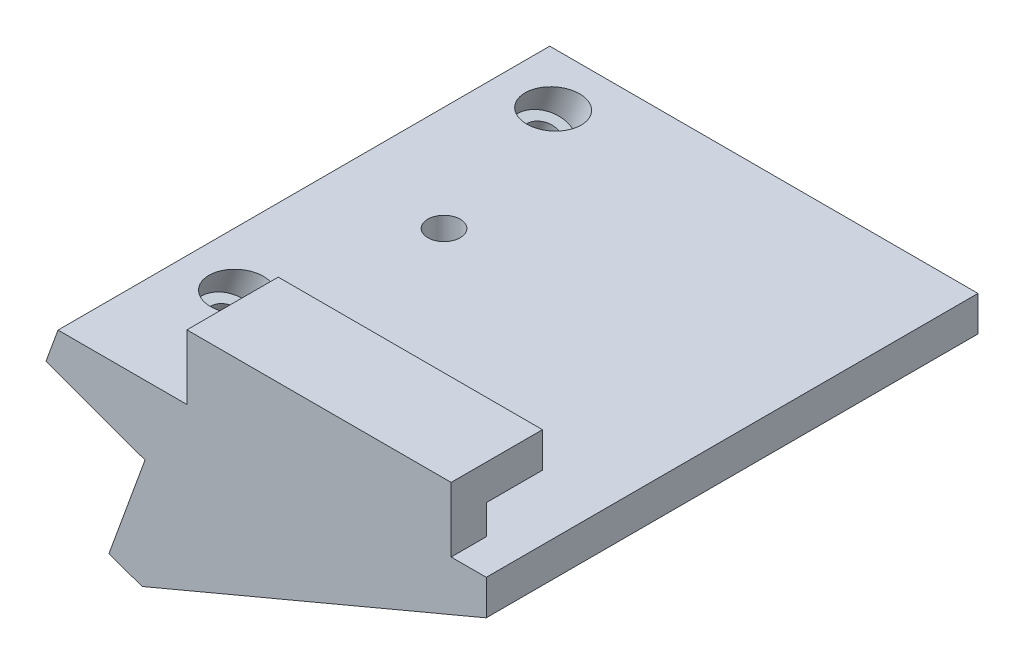
ISO-10303-21;
HEADER;
FILE_DESCRIPTION(('STEP AP214'),'2;1');
FILE_NAME('part.step','',(''),(''),'','','');
FILE_SCHEMA(('AUTOMOTIVE_DESIGN { 1 0 10303 214 1 1 1 1 }'));
ENDSEC;
DATA;
#1=APPLICATION_CONTEXT('core data for automotive mechanical design processes');
#2=APPLICATION_PROTOCOL_DEFINITION('international standard','automotive_design',2000,#1);
#3=PRODUCT_CONTEXT('',#1,'mechanical');
#4=PRODUCT('Part','Part','',(#3));
#5=PRODUCT_RELATED_PRODUCT_CATEGORY('part','',(#4));
#6=PRODUCT_DEFINITION_FORMATION('','',#4);
#7=PRODUCT_DEFINITION_CONTEXT('part definition',#1,'design');
#8=PRODUCT_DEFINITION('design','',#6,#7);
#9=PRODUCT_DEFINITION_SHAPE('','',#8);
#10=(LENGTH_UNIT() NAMED_UNIT(*) SI_UNIT(.MILLI.,.METRE.));
#11=(NAMED_UNIT(*) PLANE_ANGLE_UNIT() SI_UNIT($,.RADIAN.));
#12=(NAMED_UNIT(*) SI_UNIT($,.STERADIAN.) SOLID_ANGLE_UNIT());
#13=UNCERTAINTY_MEASURE_WITH_UNIT(LENGTH_MEASURE(1.E-05),#10,'distance_accuracy_value','');
#14=(GEOMETRIC_REPRESENTATION_CONTEXT(3) GLOBAL_UNCERTAINTY_ASSIGNED_CONTEXT((#13)) GLOBAL_UNIT_ASSIGNED_CONTEXT((#10,
#11,#12)) REPRESENTATION_CONTEXT('',''));
#15=CARTESIAN_POINT('',(0.,0.,0.));
#16=DIRECTION('',(0.,0.,1.));
#17=DIRECTION('',(1.,0.,0.));
#18=AXIS2_PLACEMENT_3D('',#15,#16,#17);
#19=CARTESIAN_POINT('',(0.,0.,65.));
#20=DIRECTION('',(0.,0.,-1.));
#21=DIRECTION('',(-1.,0.,0.));
#22=AXIS2_PLACEMENT_3D('',#19,#20,#21);
#23=PLANE('',#22);
#24=DIRECTION('',(0.,1.,0.));
#25=VECTOR('',#24,1.);
#26=CARTESIAN_POINT('',(48.7076801418633,28.1241545656032,65.));
#27=LINE('',#26,#25);
#28=CARTESIAN_POINT('',(48.7076801418633,23.9241545656032,65.));
#29=VERTEX_POINT('',#28);
#30=CARTESIAN_POINT('',(48.7076801418633,28.1241545656032,65.));
#31=VERTEX_POINT('',#30);
#32=EDGE_CURVE('E137',#29,#31,#27,.T.);
#33=ORIENTED_EDGE('',*,*,#32,.F.);
#34=DIRECTION('',(-1.,0.,0.));
#35=VECTOR('',#34,1.);
#36=CARTESIAN_POINT('',(-7.25498644527533,23.9241545656032,65.));
#37=LINE('',#36,#35);
#38=CARTESIAN_POINT('',(11.0935397099737,23.9241545656032,65.));
#39=VERTEX_POINT('',#38);
#40=EDGE_CURVE('E201',#29,#39,#37,.T.);
#41=ORIENTED_EDGE('',*,*,#40,.T.);
#42=DIRECTION('',(0.,-1.,0.));
#43=VECTOR('',#42,1.);
#44=CARTESIAN_POINT('',(11.0935397099737,0.,65.));
#45=LINE('',#44,#43);
#46=CARTESIAN_POINT('',(11.0935397099737,28.1241545656032,65.));
#47=VERTEX_POINT('',#46);
#48=EDGE_CURVE('E156',#47,#39,#45,.T.);
#49=ORIENTED_EDGE('',*,*,#48,.F.);
#50=DIRECTION('',(-1.,0.,0.));
#51=VECTOR('',#50,1.);
#52=CARTESIAN_POINT('',(-5.72631146135729,28.1241545656032,65.));
#53=LINE('',#52,#51);
#54=EDGE_CURVE('E149',#31,#47,#53,.T.);
#55=ORIENTED_EDGE('',*,*,#54,.F.);
#56=EDGE_LOOP('',(#33,#41,#49,#55));
#57=FACE_BOUND('',#56,.T.);
#58=ADVANCED_FACE('F41',(#57),#23,.T.);
#59=CARTESIAN_POINT('',(4.69846310392955,-1.71010071662833,65.));
#60=DIRECTION('',(0.342020143325665,0.93969262078591,0.));
#61=DIRECTION('',(-0.93969262078591,0.342020143325665,0.));
#62=AXIS2_PLACEMENT_3D('',#59,#60,#61);
#63=PLANE('',#62);
#64=DIRECTION('',(0.93969262078591,-0.342020143325665,0.));
#65=VECTOR('',#64,1.);
#66=CARTESIAN_POINT('',(4.69846310392955,-1.71010071662833,0.));
#67=LINE('',#66,#65);
#68=CARTESIAN_POINT('',(0.,0.,0.));
#69=VERTEX_POINT('',#68);
#70=CARTESIAN_POINT('',(4.69846310392955,-1.71010071662833,0.));
#71=VERTEX_POINT('',#70);
#72=EDGE_CURVE('E197',#69,#71,#67,.T.);
#73=ORIENTED_EDGE('',*,*,#72,.T.);
#74=DIRECTION('',(0.,0.,-1.));
#75=VECTOR('',#74,1.);
#76=CARTESIAN_POINT('',(4.69846310392955,-1.71010071662833,65.));
#77=LINE('',#76,#75);
#78=CARTESIAN_POINT('',(4.69846310392955,-1.71010071662833,70.));
#79=VERTEX_POINT('',#78);
#80=EDGE_CURVE('E11',#79,#71,#77,.T.);
#81=ORIENTED_EDGE('',*,*,#80,.F.);
#82=DIRECTION('',(-0.93969262078591,0.342020143325665,0.));
#83=VECTOR('',#82,1.);
#84=CARTESIAN_POINT('',(4.69846310392955,-1.71010071662833,70.));
#85=LINE('',#84,#83);
#86=CARTESIAN_POINT('',(0.,0.,70.));
#87=VERTEX_POINT('',#86);
#88=EDGE_CURVE('E175',#79,#87,#85,.T.);
#89=ORIENTED_EDGE('',*,*,#88,.T.);
#90=DIRECTION('',(0.,0.,-1.));
#91=VECTOR('',#90,1.);
#92=CARTESIAN_POINT('',(0.,0.,65.));
#93=LINE('',#92,#91);
#94=EDGE_CURVE('E203',#87,#69,#93,.T.);
#95=ORIENTED_EDGE('',*,*,#94,.T.);
#96=EDGE_LOOP('',(#73,#81,#89,#95));
#97=FACE_BOUND('',#96,.T.);
#98=ADVANCED_FACE('F43',(#97),#63,.F.);
#99=CARTESIAN_POINT('',(53.7076801418633,18.9241545656032,65.));
#100=DIRECTION('',(-0.388037759372495,0.921643476242942,0.));
#101=DIRECTION('',(-0.921643476242942,-0.388037759372495,0.));
#102=AXIS2_PLACEMENT_3D('',#99,#100,#101);
#103=PLANE('',#102);
#104=DIRECTION('',(0.921643476242942,0.388037759372495,0.));
#105=VECTOR('',#104,1.);
#106=CARTESIAN_POINT('',(53.7076801418633,18.9241545656032,0.));
#107=LINE('',#106,#105);
#108=CARTESIAN_POINT('',(53.7076801418633,18.9241545656032,0.));
#109=VERTEX_POINT('',#108);
#110=EDGE_CURVE('E207',#71,#109,#107,.T.);
#111=ORIENTED_EDGE('',*,*,#110,.T.);
#112=DIRECTION('',(0.,0.,-1.));
#113=VECTOR('',#112,1.);
#114=CARTESIAN_POINT('',(53.7076801418633,18.9241545656032,65.));
#115=LINE('',#114,#113);
#116=CARTESIAN_POINT('',(53.7076801418633,18.9241545656032,70.));
#117=VERTEX_POINT('',#116);
#118=EDGE_CURVE('E50',#117,#109,#115,.T.);
#119=ORIENTED_EDGE('',*,*,#118,.F.);
#120=DIRECTION('',(-0.921643476242942,-0.388037759372495,0.));
#121=VECTOR('',#120,1.);
#122=CARTESIAN_POINT('',(53.7076801418633,18.9241545656032,70.));
#123=LINE('',#122,#121);
#124=EDGE_CURVE('E172',#117,#79,#123,.T.);
#125=ORIENTED_EDGE('',*,*,#124,.T.);
#126=ORIENTED_EDGE('',*,*,#80,.T.);
#127=EDGE_LOOP('',(#111,#119,#125,#126));
#128=FACE_BOUND('',#127,.T.);
#129=ADVANCED_FACE('F271',(#128),#103,.F.);
#130=CARTESIAN_POINT('',(53.7076801418633,23.9241545656032,65.));
#131=DIRECTION('',(-1.,0.,0.));
#132=DIRECTION('',(0.,0.,1.));
#133=AXIS2_PLACEMENT_3D('',#130,#131,#132);
#134=PLANE('',#133);
#135=DIRECTION('',(0.,0.,-1.));
#136=VECTOR('',#135,1.);
#137=CARTESIAN_POINT('',(53.7076801418633,23.9241545656032,65.));
#138=LINE('',#137,#136);
#139=CARTESIAN_POINT('',(53.7076801418633,23.9241545656032,70.));
#140=VERTEX_POINT('',#139);
#141=CARTESIAN_POINT('',(53.7076801418633,23.9241545656032,0.));
#142=VERTEX_POINT('',#141);
#143=EDGE_CURVE('E229',#140,#142,#138,.T.);
#144=ORIENTED_EDGE('',*,*,#143,.F.);
#145=DIRECTION('',(0.,-1.,0.));
#146=VECTOR('',#145,1.);
#147=CARTESIAN_POINT('',(53.7076801418633,33.1241545656032,70.));
#148=LINE('',#147,#146);
#149=EDGE_CURVE('E170',#140,#117,#148,.T.);
#150=ORIENTED_EDGE('',*,*,#149,.T.);
#151=ORIENTED_EDGE('',*,*,#118,.T.);
#152=DIRECTION('',(0.,1.,0.));
#153=VECTOR('',#152,1.);
#154=CARTESIAN_POINT('',(53.7076801418633,23.9241545656032,0.));
#155=LINE('',#154,#153);
#156=EDGE_CURVE('E209',#109,#142,#155,.T.);
#157=ORIENTED_EDGE('',*,*,#156,.T.);
#158=EDGE_LOOP('',(#144,#150,#151,#157));
#159=FACE_BOUND('',#158,.T.);
#160=ADVANCED_FACE('F317',(#159),#134,.F.);
#161=CARTESIAN_POINT('',(-7.25498644527533,23.9241545656032,65.));
#162=DIRECTION('',(0.,-1.,0.));
#163=DIRECTION('',(0.,0.,-1.));
#164=AXIS2_PLACEMENT_3D('',#161,#162,#163);
#165=PLANE('',#164);
#166=DIRECTION('',(0.,0.,-1.));
#167=VECTOR('',#166,1.);
#168=CARTESIAN_POINT('',(-7.25498644527533,23.9241545656032,65.));
#169=LINE('',#168,#167);
#170=CARTESIAN_POINT('',(-7.25498644527533,23.9241545656032,70.));
#171=VERTEX_POINT('',#170);
#172=CARTESIAN_POINT('',(-7.25498644527533,23.9241545656032,0.));
#173=VERTEX_POINT('',#172);
#174=EDGE_CURVE('E227',#171,#173,#169,.T.);
#175=ORIENTED_EDGE('',*,*,#174,.F.);
#176=DIRECTION('',(-1.,0.,0.));
#177=VECTOR('',#176,1.);
#178=CARTESIAN_POINT('',(-7.25498644527533,23.9241545656032,70.));
#179=LINE('',#178,#177);
#180=CARTESIAN_POINT('',(11.0935397099737,23.9241545656032,70.));
#181=VERTEX_POINT('',#180);
#182=EDGE_CURVE('E298',#181,#171,#179,.T.);
#183=ORIENTED_EDGE('',*,*,#182,.F.);
#184=DIRECTION('',(0.,0.,-1.));
#185=VECTOR('',#184,1.);
#186=CARTESIAN_POINT('',(11.0935397099737,23.9241545656032,70.));
#187=LINE('',#186,#185);
#188=EDGE_CURVE('E304',#181,#39,#187,.T.);
#189=ORIENTED_EDGE('',*,*,#188,.T.);
#190=ORIENTED_EDGE('',*,*,#40,.F.);
#191=DIRECTION('',(0.,0.,-1.));
#192=VECTOR('',#191,1.);
#193=CARTESIAN_POINT('',(48.7076801418633,23.9241545656032,65.));
#194=LINE('',#193,#192);
#195=CARTESIAN_POINT('',(48.7076801418633,23.9241545656032,70.));
#196=VERTEX_POINT('',#195);
#197=EDGE_CURVE('E140',#196,#29,#194,.T.);
#198=ORIENTED_EDGE('',*,*,#197,.F.);
#199=DIRECTION('',(1.,0.,0.));
#200=VECTOR('',#199,1.);
#201=CARTESIAN_POINT('',(48.7076801418633,23.9241545656032,70.));
#202=LINE('',#201,#200);
#203=EDGE_CURVE('E295',#196,#140,#202,.T.);
#204=ORIENTED_EDGE('',*,*,#203,.T.);
#205=ORIENTED_EDGE('',*,*,#143,.T.);
#206=DIRECTION('',(-1.,0.,0.));
#207=VECTOR('',#206,1.);
#208=CARTESIAN_POINT('',(-7.25498644527533,23.9241545656032,0.));
#209=LINE('',#208,#207);
#210=EDGE_CURVE('E211',#142,#173,#209,.T.);
#211=ORIENTED_EDGE('',*,*,#210,.T.);
#212=EDGE_LOOP('',(#175,#183,#189,#190,#198,#204,#205,#211));
#213=FACE_BOUND('',#212,.T.);
#214=CARTESIAN_POINT('',(7.69501355472467,23.9241545656032,30.));
#215=DIRECTION('',(0.,1.,0.));
#216=DIRECTION('',(0.,0.,1.));
#217=AXIS2_PLACEMENT_3D('',#214,#215,#216);
#218=CIRCLE('',#217,2.3);
#219=CARTESIAN_POINT('',(7.69501355472467,23.9241545656032,32.3));
#220=VERTEX_POINT('',#219);
#221=EDGE_CURVE('E163',#220,#220,#218,.T.);
#222=ORIENTED_EDGE('',*,*,#221,.F.);
#223=EDGE_LOOP('',(#222));
#224=FACE_BOUND('',#223,.T.);
#225=CARTESIAN_POINT('',(0.726346848294,23.9241545656032,52.5));
#226=DIRECTION('',(0.,-1.,0.));
#227=DIRECTION('',(-1.,0.,0.));
#228=AXIS2_PLACEMENT_3D('',#225,#226,#227);
#229=ELLIPSE('',#228,3.99066664678467,3.75);
#230=CARTESIAN_POINT('',(-3.26431979849067,23.9241545656032,52.5));
#231=VERTEX_POINT('',#230);
#232=EDGE_CURVE('E45',#231,#231,#229,.T.);
#233=ORIENTED_EDGE('',*,*,#232,.T.);
#234=EDGE_LOOP('',(#233));
#235=FACE_BOUND('',#234,.T.);
#236=CARTESIAN_POINT('',(0.726346848293999,23.9241545656032,7.5));
#237=DIRECTION('',(0.,-1.,0.));
#238=DIRECTION('',(-1.,0.,0.));
#239=AXIS2_PLACEMENT_3D('',#236,#237,#238);
#240=ELLIPSE('',#239,3.99066664678467,3.75);
#241=CARTESIAN_POINT('',(-3.26431979849067,23.9241545656032,7.5));
#242=VERTEX_POINT('',#241);
#243=EDGE_CURVE('E238',#242,#242,#240,.T.);
#244=ORIENTED_EDGE('',*,*,#243,.T.);
#245=EDGE_LOOP('',(#244));
#246=FACE_BOUND('',#245,.T.);
#247=ADVANCED_FACE('F245',(#213,#224,#235,#246),#165,.F.);
#248=CARTESIAN_POINT('',(-8.96508716190366,19.2256914616736,65.));
#249=DIRECTION('',(0.93969262078591,-0.342020143325665,0.));
#250=DIRECTION('',(0.342020143325665,0.93969262078591,0.));
#251=AXIS2_PLACEMENT_3D('',#248,#249,#250);
#252=PLANE('',#251);
#253=DIRECTION('',(0.342020143325666,0.939692620785909,0.));
#254=VECTOR('',#253,1.);
#255=CARTESIAN_POINT('',(-8.96508716190366,19.2256914616736,70.));
#256=LINE('',#255,#254);
#257=CARTESIAN_POINT('',(-8.96508716190366,19.2256914616736,70.));
#258=VERTEX_POINT('',#257);
#259=EDGE_CURVE('E184',#258,#171,#256,.T.);
#260=ORIENTED_EDGE('',*,*,#259,.T.);
#261=ORIENTED_EDGE('',*,*,#174,.T.);
#262=DIRECTION('',(-0.342020143325665,-0.939692620785909,0.));
#263=VECTOR('',#262,1.);
#264=CARTESIAN_POINT('',(-8.96508716190366,19.2256914616736,0.));
#265=LINE('',#264,#263);
#266=CARTESIAN_POINT('',(-8.96508716190366,19.2256914616736,0.));
#267=VERTEX_POINT('',#266);
#268=EDGE_CURVE('E214',#173,#267,#265,.T.);
#269=ORIENTED_EDGE('',*,*,#268,.T.);
#270=DIRECTION('',(0.,0.,-1.));
#271=VECTOR('',#270,1.);
#272=CARTESIAN_POINT('',(-8.96508716190366,19.2256914616736,65.));
#273=LINE('',#272,#271);
#274=EDGE_CURVE('E224',#258,#267,#273,.T.);
#275=ORIENTED_EDGE('',*,*,#274,.F.);
#276=EDGE_LOOP('',(#260,#261,#269,#275));
#277=FACE_BOUND('',#276,.T.);
#278=ADVANCED_FACE('F316',(#277),#252,.F.);
#279=CARTESIAN_POINT('',(5.13030214988498,14.0953893117886,65.));
#280=DIRECTION('',(0.342020143325666,0.939692620785909,0.));
#281=DIRECTION('',(-0.93969262078591,0.342020143325666,0.));
#282=AXIS2_PLACEMENT_3D('',#279,#280,#281);
#283=PLANE('',#282);
#284=CARTESIAN_POINT('',(-1.91739250600933,16.6605403867311,7.5));
#285=DIRECTION('',(-0.342020143325666,-0.93969262078591,0.));
#286=DIRECTION('',(0.93969262078591,-0.342020143325666,0.));
#287=AXIS2_PLACEMENT_3D('',#284,#285,#286);
#288=CIRCLE('',#287,2.25);
#289=CARTESIAN_POINT('',(0.196915890758964,15.8909950642484,7.5));
#290=VERTEX_POINT('',#289);
#291=EDGE_CURVE('E194',#290,#290,#288,.T.);
#292=ORIENTED_EDGE('',*,*,#291,.F.);
#293=EDGE_LOOP('',(#292));
#294=FACE_BOUND('',#293,.T.);
#295=CARTESIAN_POINT('',(-1.91739250600933,16.6605403867311,52.5));
#296=DIRECTION('',(-0.342020143325666,-0.93969262078591,0.));
#297=DIRECTION('',(0.93969262078591,-0.342020143325666,0.));
#298=AXIS2_PLACEMENT_3D('',#295,#296,#297);
#299=CIRCLE('',#298,2.25);
#300=CARTESIAN_POINT('',(0.196915890758965,15.8909950642484,52.5));
#301=VERTEX_POINT('',#300);
#302=EDGE_CURVE('E198',#301,#301,#299,.T.);
#303=ORIENTED_EDGE('',*,*,#302,.F.);
#304=EDGE_LOOP('',(#303));
#305=FACE_BOUND('',#304,.T.);
#306=DIRECTION('',(0.93969262078591,-0.342020143325666,0.));
#307=VECTOR('',#306,1.);
#308=CARTESIAN_POINT('',(5.13030214988498,14.0953893117886,0.));
#309=LINE('',#308,#307);
#310=CARTESIAN_POINT('',(5.13030214988498,14.0953893117886,0.));
#311=VERTEX_POINT('',#310);
#312=EDGE_CURVE('E216',#267,#311,#309,.T.);
#313=ORIENTED_EDGE('',*,*,#312,.T.);
#314=DIRECTION('',(0.,0.,-1.));
#315=VECTOR('',#314,1.);
#316=CARTESIAN_POINT('',(5.13030214988498,14.0953893117886,65.));
#317=LINE('',#316,#315);
#318=CARTESIAN_POINT('',(5.13030214988498,14.0953893117886,70.));
#319=VERTEX_POINT('',#318);
#320=EDGE_CURVE('E221',#319,#311,#317,.T.);
#321=ORIENTED_EDGE('',*,*,#320,.F.);
#322=DIRECTION('',(-0.93969262078591,0.342020143325666,0.));
#323=VECTOR('',#322,1.);
#324=CARTESIAN_POINT('',(5.13030214988498,14.0953893117886,70.));
#325=LINE('',#324,#323);
#326=EDGE_CURVE('E181',#319,#258,#325,.T.);
#327=ORIENTED_EDGE('',*,*,#326,.T.);
#328=ORIENTED_EDGE('',*,*,#274,.T.);
#329=EDGE_LOOP('',(#313,#321,#327,#328));
#330=FACE_BOUND('',#329,.T.);
#331=ADVANCED_FACE('F323',(#294,#305,#330),#283,.F.);
#332=CARTESIAN_POINT('',(0.,0.,65.));
#333=DIRECTION('',(0.939692620785909,-0.342020143325666,0.));
#334=DIRECTION('',(0.342020143325666,0.93969262078591,0.));
#335=AXIS2_PLACEMENT_3D('',#332,#333,#334);
#336=PLANE('',#335);
#337=DIRECTION('',(-0.342020143325666,-0.939692620785909,0.));
#338=VECTOR('',#337,1.);
#339=CARTESIAN_POINT('',(0.,0.,0.));
#340=LINE('',#339,#338);
#341=EDGE_CURVE('E204',#311,#69,#340,.T.);
#342=ORIENTED_EDGE('',*,*,#341,.T.);
#343=ORIENTED_EDGE('',*,*,#94,.F.);
#344=DIRECTION('',(0.342020143325666,0.939692620785909,0.));
#345=VECTOR('',#344,1.);
#346=CARTESIAN_POINT('',(0.,0.,70.));
#347=LINE('',#346,#345);
#348=EDGE_CURVE('E178',#87,#319,#347,.T.);
#349=ORIENTED_EDGE('',*,*,#348,.T.);
#350=ORIENTED_EDGE('',*,*,#320,.T.);
#351=EDGE_LOOP('',(#342,#343,#349,#350));
#352=FACE_BOUND('',#351,.T.);
#353=ADVANCED_FACE('F352',(#352),#336,.F.);
#354=CARTESIAN_POINT('',(0.,0.,0.));
#355=DIRECTION('',(0.,0.,-1.));
#356=DIRECTION('',(-1.,0.,0.));
#357=AXIS2_PLACEMENT_3D('',#354,#355,#356);
#358=PLANE('',#357);
#359=ORIENTED_EDGE('',*,*,#72,.F.);
#360=ORIENTED_EDGE('',*,*,#341,.F.);
#361=ORIENTED_EDGE('',*,*,#312,.F.);
#362=ORIENTED_EDGE('',*,*,#268,.F.);
#363=ORIENTED_EDGE('',*,*,#210,.F.);
#364=ORIENTED_EDGE('',*,*,#156,.F.);
#365=ORIENTED_EDGE('',*,*,#110,.F.);
#366=EDGE_LOOP('',(#359,#360,#361,#362,#363,#364,#365));
#367=FACE_BOUND('',#366,.T.);
#368=ADVANCED_FACE('F341',(#367),#358,.T.);
#369=CARTESIAN_POINT('',(13.13149380032,58.0070157013112,52.5));
#370=DIRECTION('',(-0.342020143325666,-0.939692620785909,0.));
#371=DIRECTION('',(0.93969262078591,-0.342020143325666,0.));
#372=AXIS2_PLACEMENT_3D('',#369,#370,#371);
#373=CYLINDRICAL_SURFACE('',#372,2.25);
#374=CARTESIAN_POINT('',(-0.891332076032338,19.4796182490889,52.5));
#375=DIRECTION('',(-0.342020143325666,-0.93969262078591,0.));
#376=DIRECTION('',(0.93969262078591,-0.342020143325666,0.));
#377=AXIS2_PLACEMENT_3D('',#374,#375,#376);
#378=CIRCLE('',#377,2.25);
#379=CARTESIAN_POINT('',(1.22297632073596,18.7100729266061,52.5));
#380=VERTEX_POINT('',#379);
#381=EDGE_CURVE('E236',#380,#380,#378,.F.);
#382=ORIENTED_EDGE('',*,*,#381,.T.);
#383=EDGE_LOOP('',(#382));
#384=FACE_BOUND('',#383,.T.);
#385=ORIENTED_EDGE('',*,*,#302,.T.);
#386=EDGE_LOOP('',(#385));
#387=FACE_BOUND('',#386,.T.);
#388=ADVANCED_FACE('F457',(#384,#387),#373,.F.);
#389=CARTESIAN_POINT('',(13.13149380032,58.0070157013112,7.5));
#390=DIRECTION('',(-0.342020143325666,-0.939692620785909,0.));
#391=DIRECTION('',(0.93969262078591,-0.342020143325666,0.));
#392=AXIS2_PLACEMENT_3D('',#389,#390,#391);
#393=CYLINDRICAL_SURFACE('',#392,2.25);
#394=CARTESIAN_POINT('',(-0.891332076032335,19.4796182490889,7.5));
#395=DIRECTION('',(-0.342020143325666,-0.93969262078591,0.));
#396=DIRECTION('',(0.93969262078591,-0.342020143325666,0.));
#397=AXIS2_PLACEMENT_3D('',#394,#395,#396);
#398=CIRCLE('',#397,2.25);
#399=CARTESIAN_POINT('',(1.22297632073596,18.7100729266061,7.5));
#400=VERTEX_POINT('',#399);
#401=EDGE_CURVE('E191',#400,#400,#398,.F.);
#402=ORIENTED_EDGE('',*,*,#401,.T.);
#403=EDGE_LOOP('',(#402));
#404=FACE_BOUND('',#403,.T.);
#405=ORIENTED_EDGE('',*,*,#291,.T.);
#406=EDGE_LOOP('',(#405));
#407=FACE_BOUND('',#406,.T.);
#408=ADVANCED_FACE('F449',(#404,#407),#393,.F.);
#409=CARTESIAN_POINT('',(14.157554230297,60.8260935636689,7.5));
#410=DIRECTION('',(-0.342020143325666,-0.939692620785909,0.));
#411=DIRECTION('',(0.93969262078591,-0.342020143325666,0.));
#412=AXIS2_PLACEMENT_3D('',#409,#410,#411);
#413=CYLINDRICAL_SURFACE('',#412,3.75);
#414=CARTESIAN_POINT('',(-0.891332076032338,19.4796182490889,7.5));
#415=DIRECTION('',(-0.342020143325666,-0.93969262078591,0.));
#416=DIRECTION('',(0.93969262078591,-0.342020143325666,0.));
#417=AXIS2_PLACEMENT_3D('',#414,#415,#416);
#418=CIRCLE('',#417,3.75);
#419=CARTESIAN_POINT('',(2.63251525191482,18.1970427116176,7.5));
#420=VERTEX_POINT('',#419);
#421=EDGE_CURVE('E187',#420,#420,#418,.T.);
#422=ORIENTED_EDGE('',*,*,#421,.T.);
#423=EDGE_LOOP('',(#422));
#424=FACE_BOUND('',#423,.T.);
#425=ORIENTED_EDGE('',*,*,#243,.F.);
#426=EDGE_LOOP('',(#425));
#427=FACE_BOUND('',#426,.T.);
#428=ADVANCED_FACE('F260',(#424,#427),#413,.F.);
#429=CARTESIAN_POINT('',(-0.891332076032338,19.4796182490889,7.5));
#430=DIRECTION('',(-0.342020143325666,-0.93969262078591,0.));
#431=DIRECTION('',(0.93969262078591,-0.342020143325666,0.));
#432=AXIS2_PLACEMENT_3D('',#429,#430,#431);
#433=PLANE('',#432);
#434=ORIENTED_EDGE('',*,*,#421,.F.);
#435=EDGE_LOOP('',(#434));
#436=FACE_BOUND('',#435,.T.);
#437=ORIENTED_EDGE('',*,*,#401,.F.);
#438=EDGE_LOOP('',(#437));
#439=FACE_BOUND('',#438,.T.);
#440=ADVANCED_FACE('F250',(#436,#439),#433,.F.);
#441=CARTESIAN_POINT('',(14.157554230297,60.8260935636689,52.5));
#442=DIRECTION('',(-0.342020143325666,-0.939692620785909,0.));
#443=DIRECTION('',(0.93969262078591,-0.342020143325666,0.));
#444=AXIS2_PLACEMENT_3D('',#441,#442,#443);
#445=CYLINDRICAL_SURFACE('',#444,3.75);
#446=CARTESIAN_POINT('',(-0.891332076032337,19.4796182490889,52.5));
#447=DIRECTION('',(-0.342020143325666,-0.93969262078591,0.));
#448=DIRECTION('',(0.93969262078591,-0.342020143325666,0.));
#449=AXIS2_PLACEMENT_3D('',#446,#447,#448);
#450=CIRCLE('',#449,3.75);
#451=CARTESIAN_POINT('',(2.63251525191483,18.1970427116176,52.5));
#452=VERTEX_POINT('',#451);
#453=EDGE_CURVE('E188',#452,#452,#450,.T.);
#454=ORIENTED_EDGE('',*,*,#453,.T.);
#455=EDGE_LOOP('',(#454));
#456=FACE_BOUND('',#455,.T.);
#457=ORIENTED_EDGE('',*,*,#232,.F.);
#458=EDGE_LOOP('',(#457));
#459=FACE_BOUND('',#458,.T.);
#460=ADVANCED_FACE('F247',(#456,#459),#445,.F.);
#461=CARTESIAN_POINT('',(-0.891332076032337,19.4796182490889,52.5));
#462=DIRECTION('',(-0.342020143325666,-0.93969262078591,0.));
#463=DIRECTION('',(0.93969262078591,-0.342020143325666,0.));
#464=AXIS2_PLACEMENT_3D('',#461,#462,#463);
#465=PLANE('',#464);
#466=ORIENTED_EDGE('',*,*,#453,.F.);
#467=EDGE_LOOP('',(#466));
#468=FACE_BOUND('',#467,.T.);
#469=ORIENTED_EDGE('',*,*,#381,.F.);
#470=EDGE_LOOP('',(#469));
#471=FACE_BOUND('',#470,.T.);
#472=ADVANCED_FACE('F249',(#468,#471),#465,.F.);
#473=CARTESIAN_POINT('',(-3.9064602900263,33.1241545656032,70.));
#474=DIRECTION('',(0.,1.,0.));
#475=DIRECTION('',(-1.,0.,0.));
#476=AXIS2_PLACEMENT_3D('',#473,#474,#475);
#477=PLANE('',#476);
#478=DIRECTION('',(0.,0.,1.));
#479=VECTOR('',#478,1.);
#480=CARTESIAN_POINT('',(48.7076801418633,33.1241545656032,70.));
#481=LINE('',#480,#479);
#482=CARTESIAN_POINT('',(48.7076801418633,33.1241545656032,57.));
#483=VERTEX_POINT('',#482);
#484=CARTESIAN_POINT('',(48.7076801418633,33.1241545656032,70.));
#485=VERTEX_POINT('',#484);
#486=EDGE_CURVE('E286',#483,#485,#481,.T.);
#487=ORIENTED_EDGE('',*,*,#486,.F.);
#488=DIRECTION('',(1.,0.,0.));
#489=VECTOR('',#488,1.);
#490=CARTESIAN_POINT('',(53.7076801418633,33.1241545656032,57.));
#491=LINE('',#490,#489);
#492=CARTESIAN_POINT('',(11.0935397099737,33.1241545656032,57.));
#493=VERTEX_POINT('',#492);
#494=EDGE_CURVE('E157',#493,#483,#491,.T.);
#495=ORIENTED_EDGE('',*,*,#494,.F.);
#496=DIRECTION('',(0.,0.,-1.));
#497=VECTOR('',#496,1.);
#498=CARTESIAN_POINT('',(11.0935397099737,33.1241545656032,70.));
#499=LINE('',#498,#497);
#500=CARTESIAN_POINT('',(11.0935397099737,33.1241545656032,70.));
#501=VERTEX_POINT('',#500);
#502=EDGE_CURVE('E66',#501,#493,#499,.T.);
#503=ORIENTED_EDGE('',*,*,#502,.F.);
#504=DIRECTION('',(1.,0.,0.));
#505=VECTOR('',#504,1.);
#506=CARTESIAN_POINT('',(-3.9064602900263,33.1241545656032,70.));
#507=LINE('',#506,#505);
#508=EDGE_CURVE('E167',#501,#485,#507,.T.);
#509=ORIENTED_EDGE('',*,*,#508,.T.);
#510=EDGE_LOOP('',(#487,#495,#503,#509));
#511=FACE_BOUND('',#510,.T.);
#512=ADVANCED_FACE('F257',(#511),#477,.T.);
#513=CARTESIAN_POINT('',(0.,0.,70.));
#514=DIRECTION('',(0.,0.,-1.));
#515=DIRECTION('',(-1.,0.,0.));
#516=AXIS2_PLACEMENT_3D('',#513,#514,#515);
#517=PLANE('',#516);
#518=ORIENTED_EDGE('',*,*,#149,.F.);
#519=ORIENTED_EDGE('',*,*,#203,.F.);
#520=DIRECTION('',(0.,-1.,0.));
#521=VECTOR('',#520,1.);
#522=CARTESIAN_POINT('',(48.7076801418633,33.1241545656032,70.));
#523=LINE('',#522,#521);
#524=EDGE_CURVE('E289',#485,#196,#523,.T.);
#525=ORIENTED_EDGE('',*,*,#524,.F.);
#526=ORIENTED_EDGE('',*,*,#508,.F.);
#527=DIRECTION('',(0.,-1.,0.));
#528=VECTOR('',#527,1.);
#529=CARTESIAN_POINT('',(11.0935397099737,23.9241545656032,70.));
#530=LINE('',#529,#528);
#531=EDGE_CURVE('E294',#501,#181,#530,.T.);
#532=ORIENTED_EDGE('',*,*,#531,.T.);
#533=ORIENTED_EDGE('',*,*,#182,.T.);
#534=ORIENTED_EDGE('',*,*,#259,.F.);
#535=ORIENTED_EDGE('',*,*,#326,.F.);
#536=ORIENTED_EDGE('',*,*,#348,.F.);
#537=ORIENTED_EDGE('',*,*,#88,.F.);
#538=ORIENTED_EDGE('',*,*,#124,.F.);
#539=EDGE_LOOP('',(#518,#519,#525,#526,#532,#533,#534,#535,#536,#537,#538));
#540=FACE_BOUND('',#539,.T.);
#541=ADVANCED_FACE('F275',(#540),#517,.F.);
#542=CARTESIAN_POINT('',(-5.72631146135729,28.1241545656032,57.));
#543=DIRECTION('',(0.,1.,0.));
#544=DIRECTION('',(-1.,0.,0.));
#545=AXIS2_PLACEMENT_3D('',#542,#543,#544);
#546=PLANE('',#545);
#547=DIRECTION('',(-1.,0.,0.));
#548=VECTOR('',#547,1.);
#549=CARTESIAN_POINT('',(-5.72631146135729,28.1241545656032,57.));
#550=LINE('',#549,#548);
#551=CARTESIAN_POINT('',(48.7076801418633,28.1241545656032,57.));
#552=VERTEX_POINT('',#551);
#553=CARTESIAN_POINT('',(11.0935397099737,28.1241545656032,57.));
#554=VERTEX_POINT('',#553);
#555=EDGE_CURVE('E151',#552,#554,#550,.T.);
#556=ORIENTED_EDGE('',*,*,#555,.F.);
#557=DIRECTION('',(0.,0.,-1.));
#558=VECTOR('',#557,1.);
#559=CARTESIAN_POINT('',(48.7076801418633,28.1241545656032,57.));
#560=LINE('',#559,#558);
#561=EDGE_CURVE('E58',#31,#552,#560,.T.);
#562=ORIENTED_EDGE('',*,*,#561,.F.);
#563=ORIENTED_EDGE('',*,*,#54,.T.);
#564=DIRECTION('',(0.,0.,-1.));
#565=VECTOR('',#564,1.);
#566=CARTESIAN_POINT('',(11.0935397099737,28.1241545656032,57.));
#567=LINE('',#566,#565);
#568=EDGE_CURVE('E307',#47,#554,#567,.T.);
#569=ORIENTED_EDGE('',*,*,#568,.T.);
#570=EDGE_LOOP('',(#556,#562,#563,#569));
#571=FACE_BOUND('',#570,.T.);
#572=ADVANCED_FACE('F147',(#571),#546,.F.);
#573=CARTESIAN_POINT('',(0.,0.,57.));
#574=DIRECTION('',(0.,0.,-1.));
#575=DIRECTION('',(-1.,0.,0.));
#576=AXIS2_PLACEMENT_3D('',#573,#574,#575);
#577=PLANE('',#576);
#578=DIRECTION('',(0.,1.,0.));
#579=VECTOR('',#578,1.);
#580=CARTESIAN_POINT('',(48.7076801418633,33.1241545656032,57.));
#581=LINE('',#580,#579);
#582=EDGE_CURVE('E152',#552,#483,#581,.T.);
#583=ORIENTED_EDGE('',*,*,#582,.F.);
#584=ORIENTED_EDGE('',*,*,#555,.T.);
#585=DIRECTION('',(0.,-1.,0.));
#586=VECTOR('',#585,1.);
#587=CARTESIAN_POINT('',(11.0935397099737,23.9241545656032,57.));
#588=LINE('',#587,#586);
#589=EDGE_CURVE('E293',#493,#554,#588,.T.);
#590=ORIENTED_EDGE('',*,*,#589,.F.);
#591=ORIENTED_EDGE('',*,*,#494,.T.);
#592=EDGE_LOOP('',(#583,#584,#590,#591));
#593=FACE_BOUND('',#592,.T.);
#594=ADVANCED_FACE('F292',(#593),#577,.T.);
#595=CARTESIAN_POINT('',(7.69501355472467,20.4241545656032,30.));
#596=DIRECTION('',(0.,1.,0.));
#597=DIRECTION('',(0.,0.,1.));
#598=AXIS2_PLACEMENT_3D('',#595,#596,#597);
#599=CYLINDRICAL_SURFACE('',#598,2.3);
#600=CARTESIAN_POINT('',(7.69501355472467,20.4241545656032,30.));
#601=DIRECTION('',(0.,1.,0.));
#602=DIRECTION('',(0.,0.,1.));
#603=AXIS2_PLACEMENT_3D('',#600,#601,#602);
#604=CIRCLE('',#603,2.3);
#605=CARTESIAN_POINT('',(7.69501355472467,20.4241545656032,32.3));
#606=VERTEX_POINT('',#605);
#607=EDGE_CURVE('E158',#606,#606,#604,.T.);
#608=ORIENTED_EDGE('',*,*,#607,.F.);
#609=EDGE_LOOP('',(#608));
#610=FACE_BOUND('',#609,.T.);
#611=ORIENTED_EDGE('',*,*,#221,.T.);
#612=EDGE_LOOP('',(#611));
#613=FACE_BOUND('',#612,.T.);
#614=ADVANCED_FACE('F314',(#610,#613),#599,.F.);
#615=CARTESIAN_POINT('',(7.69501355472467,20.4241545656032,30.));
#616=DIRECTION('',(0.,1.,0.));
#617=DIRECTION('',(0.,0.,1.));
#618=AXIS2_PLACEMENT_3D('',#615,#616,#617);
#619=PLANE('',#618);
#620=ORIENTED_EDGE('',*,*,#607,.T.);
#621=EDGE_LOOP('',(#620));
#622=FACE_BOUND('',#621,.T.);
#623=ADVANCED_FACE('F359',(#622),#619,.T.);
#624=CARTESIAN_POINT('',(11.0935397099737,23.9241545656032,70.));
#625=DIRECTION('',(1.,0.,0.));
#626=DIRECTION('',(0.,0.,-1.));
#627=AXIS2_PLACEMENT_3D('',#624,#625,#626);
#628=PLANE('',#627);
#629=ORIENTED_EDGE('',*,*,#48,.T.);
#630=ORIENTED_EDGE('',*,*,#188,.F.);
#631=ORIENTED_EDGE('',*,*,#531,.F.);
#632=ORIENTED_EDGE('',*,*,#502,.T.);
#633=ORIENTED_EDGE('',*,*,#589,.T.);
#634=ORIENTED_EDGE('',*,*,#568,.F.);
#635=EDGE_LOOP('',(#629,#630,#631,#632,#633,#634));
#636=FACE_BOUND('',#635,.T.);
#637=ADVANCED_FACE('F355',(#636),#628,.F.);
#638=CARTESIAN_POINT('',(48.7076801418633,0.,0.));
#639=DIRECTION('',(-1.,0.,0.));
#640=DIRECTION('',(0.,0.,1.));
#641=AXIS2_PLACEMENT_3D('',#638,#639,#640);
#642=PLANE('',#641);
#643=ORIENTED_EDGE('',*,*,#32,.T.);
#644=ORIENTED_EDGE('',*,*,#561,.T.);
#645=ORIENTED_EDGE('',*,*,#582,.T.);
#646=ORIENTED_EDGE('',*,*,#486,.T.);
#647=ORIENTED_EDGE('',*,*,#524,.T.);
#648=ORIENTED_EDGE('',*,*,#197,.T.);
#649=EDGE_LOOP('',(#643,#644,#645,#646,#647,#648));
#650=FACE_BOUND('',#649,.T.);
#651=ADVANCED_FACE('F138',(#650),#642,.F.);
#652=CLOSED_SHELL('',(#58,#98,#129,#160,#247,#278,#331,#353,#368,#388,#408,#428,#440,#460,#472,
#512,#541,#572,#594,#614,#623,#637,#651));
#653=MANIFOLD_SOLID_BREP('B2',#652);
#654=ADVANCED_BREP_SHAPE_REPRESENTATION('',(#18,#653),#14);
#655=SHAPE_DEFINITION_REPRESENTATION(#9,#654);
ENDSEC;
END-ISO-10303-21;
